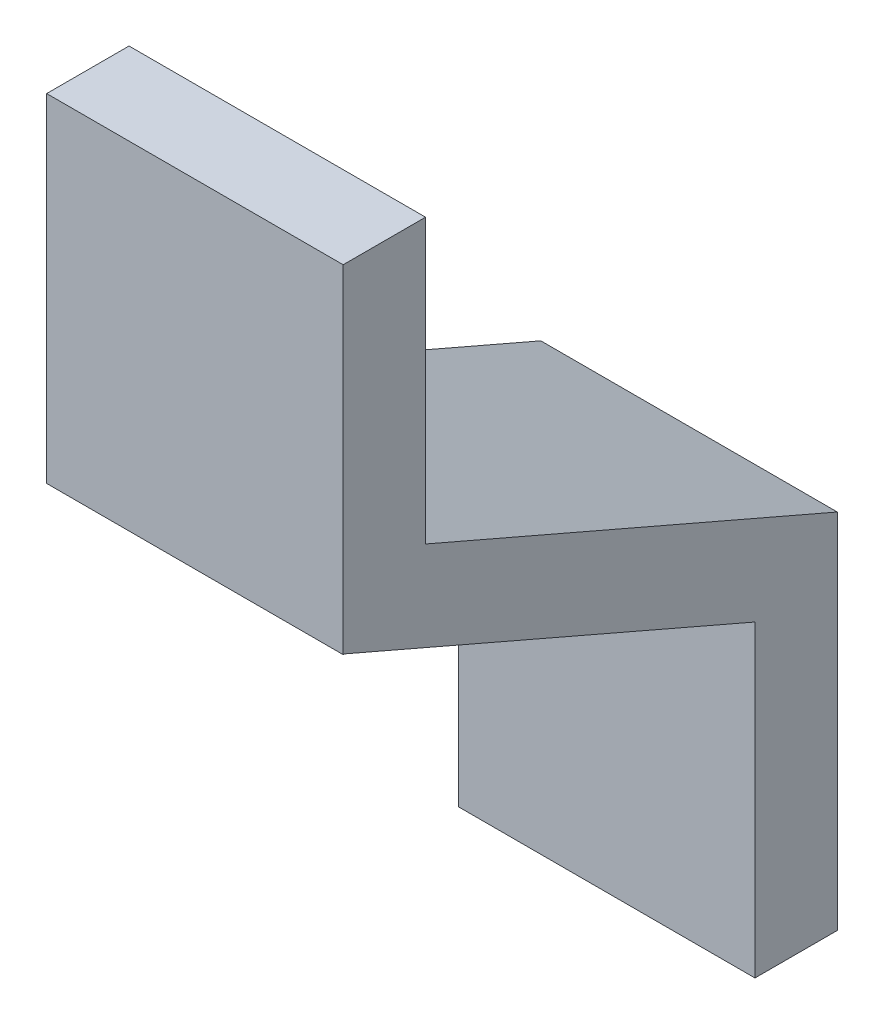
ISO-10303-21;
HEADER;
FILE_DESCRIPTION(('STEP AP214'),'2;1');
FILE_NAME('part.step','',(''),(''),'','','');
FILE_SCHEMA(('AUTOMOTIVE_DESIGN { 1 0 10303 214 1 1 1 1 }'));
ENDSEC;
DATA;
#1=APPLICATION_CONTEXT('core data for automotive mechanical design processes');
#2=APPLICATION_PROTOCOL_DEFINITION('international standard','automotive_design',2000,#1);
#3=PRODUCT_CONTEXT('',#1,'mechanical');
#4=PRODUCT('Part','Part','',(#3));
#5=PRODUCT_RELATED_PRODUCT_CATEGORY('part','',(#4));
#6=PRODUCT_DEFINITION_FORMATION('','',#4);
#7=PRODUCT_DEFINITION_CONTEXT('part definition',#1,'design');
#8=PRODUCT_DEFINITION('design','',#6,#7);
#9=PRODUCT_DEFINITION_SHAPE('','',#8);
#10=(LENGTH_UNIT() NAMED_UNIT(*) SI_UNIT(.MILLI.,.METRE.));
#11=(NAMED_UNIT(*) PLANE_ANGLE_UNIT() SI_UNIT($,.RADIAN.));
#12=(NAMED_UNIT(*) SI_UNIT($,.STERADIAN.) SOLID_ANGLE_UNIT());
#13=UNCERTAINTY_MEASURE_WITH_UNIT(LENGTH_MEASURE(1.E-05),#10,'distance_accuracy_value','');
#14=(GEOMETRIC_REPRESENTATION_CONTEXT(3) GLOBAL_UNCERTAINTY_ASSIGNED_CONTEXT((#13)) GLOBAL_UNIT_ASSIGNED_CONTEXT((#10,
#11,#12)) REPRESENTATION_CONTEXT('',''));
#15=CARTESIAN_POINT('',(0.,0.,0.));
#16=DIRECTION('',(0.,0.,1.));
#17=DIRECTION('',(1.,0.,0.));
#18=AXIS2_PLACEMENT_3D('',#15,#16,#17);
#19=CARTESIAN_POINT('',(5.02,0.999999996424,0.5));
#20=DIRECTION('',(0.,1.,0.));
#21=DIRECTION('',(0.,0.,1.));
#22=AXIS2_PLACEMENT_3D('',#19,#20,#21);
#23=PLANE('',#22);
#24=DIRECTION('',(1.,0.,0.));
#25=VECTOR('',#24,1.);
#26=CARTESIAN_POINT('',(5.02,0.999999996424,0.5));
#27=LINE('',#26,#25);
#28=CARTESIAN_POINT('',(5.380000014305,0.999999996424,0.5));
#29=VERTEX_POINT('',#28);
#30=CARTESIAN_POINT('',(5.02,0.999999996424,0.5));
#31=VERTEX_POINT('',#30);
#32=EDGE_CURVE('E140',#29,#31,#27,.F.);
#33=ORIENTED_EDGE('',*,*,#32,.T.);
#34=DIRECTION('',(0.,0.,-1.));
#35=VECTOR('',#34,1.);
#36=CARTESIAN_POINT('',(5.02,0.999999996424,0.));
#37=LINE('',#36,#35);
#38=CARTESIAN_POINT('',(5.02,0.999999996424,0.60000000149));
#39=VERTEX_POINT('',#38);
#40=EDGE_CURVE('E133',#31,#39,#37,.F.);
#41=ORIENTED_EDGE('',*,*,#40,.T.);
#42=DIRECTION('',(1.,0.,0.));
#43=VECTOR('',#42,1.);
#44=CARTESIAN_POINT('',(5.02,0.999999996424,0.60000000149));
#45=LINE('',#44,#43);
#46=CARTESIAN_POINT('',(5.380000014305,0.999999996424,0.60000000149));
#47=VERTEX_POINT('',#46);
#48=EDGE_CURVE('E129',#47,#39,#45,.F.);
#49=ORIENTED_EDGE('',*,*,#48,.F.);
#50=DIRECTION('',(0.,0.,-1.));
#51=VECTOR('',#50,1.);
#52=CARTESIAN_POINT('',(5.380000014305,0.999999996424,0.));
#53=LINE('',#52,#51);
#54=EDGE_CURVE('E106',#29,#47,#53,.F.);
#55=ORIENTED_EDGE('',*,*,#54,.F.);
#56=EDGE_LOOP('',(#33,#41,#49,#55));
#57=FACE_BOUND('',#56,.T.);
#58=ADVANCED_FACE('F17',(#57),#23,.T.);
#59=CARTESIAN_POINT('',(5.02,0.59,0.60000000149));
#60=DIRECTION('',(0.,0.,1.));
#61=DIRECTION('',(1.,0.,0.));
#62=AXIS2_PLACEMENT_3D('',#59,#60,#61);
#63=PLANE('',#62);
#64=DIRECTION('',(0.,1.,0.));
#65=VECTOR('',#64,1.);
#66=CARTESIAN_POINT('',(5.02,0.44,0.60000000149));
#67=LINE('',#66,#65);
#68=CARTESIAN_POINT('',(5.02,0.59,0.60000000149));
#69=VERTEX_POINT('',#68);
#70=EDGE_CURVE('E136',#39,#69,#67,.F.);
#71=ORIENTED_EDGE('',*,*,#70,.T.);
#72=DIRECTION('',(1.,0.,0.));
#73=VECTOR('',#72,1.);
#74=CARTESIAN_POINT('',(5.02,0.59,0.60000000149));
#75=LINE('',#74,#73);
#76=CARTESIAN_POINT('',(5.380000014305,0.59,0.60000000149));
#77=VERTEX_POINT('',#76);
#78=EDGE_CURVE('E92',#69,#77,#75,.T.);
#79=ORIENTED_EDGE('',*,*,#78,.T.);
#80=DIRECTION('',(0.,1.,0.));
#81=VECTOR('',#80,1.);
#82=CARTESIAN_POINT('',(5.380000014305,0.44,0.60000000149));
#83=LINE('',#82,#81);
#84=EDGE_CURVE('E73',#47,#77,#83,.F.);
#85=ORIENTED_EDGE('',*,*,#84,.F.);
#86=ORIENTED_EDGE('',*,*,#48,.T.);
#87=EDGE_LOOP('',(#71,#79,#85,#86));
#88=FACE_BOUND('',#87,.T.);
#89=ADVANCED_FACE('F285',(#88),#63,.T.);
#90=CARTESIAN_POINT('',(5.02,0.59,0.5));
#91=DIRECTION('',(0.,1.,0.));
#92=DIRECTION('',(0.,0.,1.));
#93=AXIS2_PLACEMENT_3D('',#90,#91,#92);
#94=PLANE('',#93);
#95=DIRECTION('',(1.,0.,0.));
#96=VECTOR('',#95,1.);
#97=CARTESIAN_POINT('',(5.02,0.590000000000416,0.59842599626982));
#98=LINE('',#97,#96);
#99=CARTESIAN_POINT('',(5.380000014305,0.590000000000104,0.598425996269911));
#100=VERTEX_POINT('',#99);
#101=CARTESIAN_POINT('',(5.02,0.590000000000104,0.59842599626991));
#102=VERTEX_POINT('',#101);
#103=EDGE_CURVE('E84',#100,#102,#98,.F.);
#104=ORIENTED_EDGE('',*,*,#103,.F.);
#105=DIRECTION('',(0.,0.,-1.));
#106=VECTOR('',#105,1.);
#107=CARTESIAN_POINT('',(5.380000014305,0.59,0.));
#108=LINE('',#107,#106);
#109=EDGE_CURVE('E20',#77,#100,#108,.T.);
#110=ORIENTED_EDGE('',*,*,#109,.F.);
#111=ORIENTED_EDGE('',*,*,#78,.F.);
#112=DIRECTION('',(0.,0.,1.));
#113=VECTOR('',#112,1.);
#114=CARTESIAN_POINT('',(5.02,0.59,0.5));
#115=LINE('',#114,#113);
#116=EDGE_CURVE('E87',#69,#102,#115,.F.);
#117=ORIENTED_EDGE('',*,*,#116,.T.);
#118=EDGE_LOOP('',(#104,#110,#111,#117));
#119=FACE_BOUND('',#118,.T.);
#120=ADVANCED_FACE('F85',(#119),#94,.F.);
#121=CARTESIAN_POINT('',(5.02,0.348224508223,0.03971472531736));
#122=DIRECTION('',(0.,-0.917754904098641,0.397147247255844));
#123=DIRECTION('',(0.,-0.397147247255844,-0.917754904098641));
#124=AXIS2_PLACEMENT_3D('',#121,#122,#123);
#125=PLANE('',#124);
#126=DIRECTION('',(0.,-0.397147247255413,-0.917754904098827));
#127=VECTOR('',#126,1.);
#128=CARTESIAN_POINT('',(5.380000014305,0.59,0.59842599627));
#129=LINE('',#128,#127);
#130=CARTESIAN_POINT('',(5.380000014305,0.37431222660502,0.10000000149));
#131=VERTEX_POINT('',#130);
#132=EDGE_CURVE('E80',#100,#131,#129,.T.);
#133=ORIENTED_EDGE('',*,*,#132,.F.);
#134=ORIENTED_EDGE('',*,*,#103,.T.);
#135=DIRECTION('',(0.,-0.397147247255413,-0.917754904098827));
#136=VECTOR('',#135,1.);
#137=CARTESIAN_POINT('',(5.02,0.59,0.59842599627));
#138=LINE('',#137,#136);
#139=CARTESIAN_POINT('',(5.02,0.374312226605,0.10000000149));
#140=VERTEX_POINT('',#139);
#141=EDGE_CURVE('E122',#102,#140,#138,.T.);
#142=ORIENTED_EDGE('',*,*,#141,.T.);
#143=DIRECTION('',(1.,0.,0.));
#144=VECTOR('',#143,1.);
#145=CARTESIAN_POINT('',(5.02,0.374312226605,0.10000000149));
#146=LINE('',#145,#144);
#147=EDGE_CURVE('E91',#131,#140,#146,.F.);
#148=ORIENTED_EDGE('',*,*,#147,.F.);
#149=EDGE_LOOP('',(#133,#134,#142,#148));
#150=FACE_BOUND('',#149,.T.);
#151=ADVANCED_FACE('F94',(#150),#125,.T.);
#152=CARTESIAN_POINT('',(5.02,0.,0.10000000149));
#153=DIRECTION('',(0.,0.,1.));
#154=DIRECTION('',(1.,0.,0.));
#155=AXIS2_PLACEMENT_3D('',#152,#153,#154);
#156=PLANE('',#155);
#157=ORIENTED_EDGE('',*,*,#147,.T.);
#158=DIRECTION('',(0.,1.,0.));
#159=VECTOR('',#158,1.);
#160=CARTESIAN_POINT('',(5.02,0.44,0.10000000149));
#161=LINE('',#160,#159);
#162=CARTESIAN_POINT('',(5.02,0.,0.10000000149));
#163=VERTEX_POINT('',#162);
#164=EDGE_CURVE('E118',#140,#163,#161,.F.);
#165=ORIENTED_EDGE('',*,*,#164,.T.);
#166=DIRECTION('',(1.,0.,0.));
#167=VECTOR('',#166,1.);
#168=CARTESIAN_POINT('',(5.02,0.,0.10000000149));
#169=LINE('',#168,#167);
#170=CARTESIAN_POINT('',(5.380000014305,0.,0.10000000149));
#171=VERTEX_POINT('',#170);
#172=EDGE_CURVE('E115',#163,#171,#169,.T.);
#173=ORIENTED_EDGE('',*,*,#172,.T.);
#174=DIRECTION('',(0.,1.,0.));
#175=VECTOR('',#174,1.);
#176=CARTESIAN_POINT('',(5.380000014305,0.44,0.10000000149));
#177=LINE('',#176,#175);
#178=EDGE_CURVE('E96',#131,#171,#177,.F.);
#179=ORIENTED_EDGE('',*,*,#178,.F.);
#180=EDGE_LOOP('',(#157,#165,#173,#179));
#181=FACE_BOUND('',#180,.T.);
#182=ADVANCED_FACE('F202',(#181),#156,.T.);
#183=CARTESIAN_POINT('',(5.02,0.,0.));
#184=DIRECTION('',(0.,1.,0.));
#185=DIRECTION('',(0.,0.,1.));
#186=AXIS2_PLACEMENT_3D('',#183,#184,#185);
#187=PLANE('',#186);
#188=DIRECTION('',(0.,0.,-1.));
#189=VECTOR('',#188,1.);
#190=CARTESIAN_POINT('',(5.02,0.,0.));
#191=LINE('',#190,#189);
#192=CARTESIAN_POINT('',(5.02,0.,0.));
#193=VERTEX_POINT('',#192);
#194=EDGE_CURVE('E121',#163,#193,#191,.T.);
#195=ORIENTED_EDGE('',*,*,#194,.T.);
#196=DIRECTION('',(1.,0.,0.));
#197=VECTOR('',#196,1.);
#198=CARTESIAN_POINT('',(5.02,0.,0.));
#199=LINE('',#198,#197);
#200=CARTESIAN_POINT('',(5.380000014305,0.,0.));
#201=VERTEX_POINT('',#200);
#202=EDGE_CURVE('E112',#193,#201,#199,.T.);
#203=ORIENTED_EDGE('',*,*,#202,.T.);
#204=DIRECTION('',(0.,0.,-1.));
#205=VECTOR('',#204,1.);
#206=CARTESIAN_POINT('',(5.380000014305,0.,0.));
#207=LINE('',#206,#205);
#208=EDGE_CURVE('E98',#171,#201,#207,.T.);
#209=ORIENTED_EDGE('',*,*,#208,.F.);
#210=ORIENTED_EDGE('',*,*,#172,.F.);
#211=EDGE_LOOP('',(#195,#203,#209,#210));
#212=FACE_BOUND('',#211,.T.);
#213=ADVANCED_FACE('F206',(#212),#187,.F.);
#214=CARTESIAN_POINT('',(5.02,0.,0.));
#215=DIRECTION('',(0.,0.,1.));
#216=DIRECTION('',(1.,0.,0.));
#217=AXIS2_PLACEMENT_3D('',#214,#215,#216);
#218=PLANE('',#217);
#219=ORIENTED_EDGE('',*,*,#202,.F.);
#220=DIRECTION('',(0.,1.,0.));
#221=VECTOR('',#220,1.);
#222=CARTESIAN_POINT('',(5.02,0.44,0.));
#223=LINE('',#222,#221);
#224=CARTESIAN_POINT('',(5.02,0.439999998997445,-1.94673175919965E-10));
#225=VERTEX_POINT('',#224);
#226=EDGE_CURVE('E178',#193,#225,#223,.T.);
#227=ORIENTED_EDGE('',*,*,#226,.T.);
#228=DIRECTION('',(1.,0.,0.));
#229=VECTOR('',#228,1.);
#230=CARTESIAN_POINT('',(5.02,0.43999999966303,-7.78692710220355E-10));
#231=LINE('',#230,#229);
#232=CARTESIAN_POINT('',(5.380000014305,0.439999998997445,-1.94673175919965E-10));
#233=VERTEX_POINT('',#232);
#234=EDGE_CURVE('E163',#225,#233,#231,.T.);
#235=ORIENTED_EDGE('',*,*,#234,.T.);
#236=DIRECTION('',(0.,1.,0.));
#237=VECTOR('',#236,1.);
#238=CARTESIAN_POINT('',(5.380000014305,0.44,0.));
#239=LINE('',#238,#237);
#240=EDGE_CURVE('E109',#201,#233,#239,.T.);
#241=ORIENTED_EDGE('',*,*,#240,.F.);
#242=EDGE_LOOP('',(#219,#227,#235,#241));
#243=FACE_BOUND('',#242,.T.);
#244=ADVANCED_FACE('F186',(#243),#218,.F.);
#245=CARTESIAN_POINT('',(5.380000014305,0.44,0.));
#246=DIRECTION('',(1.,0.,0.));
#247=DIRECTION('',(0.,0.,-1.));
#248=AXIS2_PLACEMENT_3D('',#245,#246,#247);
#249=PLANE('',#248);
#250=ORIENTED_EDGE('',*,*,#178,.T.);
#251=ORIENTED_EDGE('',*,*,#208,.T.);
#252=ORIENTED_EDGE('',*,*,#240,.T.);
#253=DIRECTION('',(0.,-0.397147247255844,-0.917754904098641));
#254=VECTOR('',#253,1.);
#255=CARTESIAN_POINT('',(5.380000014305,0.44,0.));
#256=LINE('',#255,#254);
#257=CARTESIAN_POINT('',(5.380000014305,0.656368904967003,0.499999999999999));
#258=VERTEX_POINT('',#257);
#259=EDGE_CURVE('E151',#233,#258,#256,.F.);
#260=ORIENTED_EDGE('',*,*,#259,.T.);
#261=DIRECTION('',(0.,1.,0.));
#262=VECTOR('',#261,1.);
#263=CARTESIAN_POINT('',(5.380000014305,0.59,0.5));
#264=LINE('',#263,#262);
#265=EDGE_CURVE('E144',#258,#29,#264,.T.);
#266=ORIENTED_EDGE('',*,*,#265,.T.);
#267=ORIENTED_EDGE('',*,*,#54,.T.);
#268=ORIENTED_EDGE('',*,*,#84,.T.);
#269=ORIENTED_EDGE('',*,*,#109,.T.);
#270=ORIENTED_EDGE('',*,*,#132,.T.);
#271=EDGE_LOOP('',(#250,#251,#252,#260,#266,#267,#268,#269,#270));
#272=FACE_BOUND('',#271,.T.);
#273=ADVANCED_FACE('F78',(#272),#249,.T.);
#274=CARTESIAN_POINT('',(5.02,0.59,0.5));
#275=DIRECTION('',(0.,0.,1.));
#276=DIRECTION('',(1.,0.,0.));
#277=AXIS2_PLACEMENT_3D('',#274,#275,#276);
#278=PLANE('',#277);
#279=ORIENTED_EDGE('',*,*,#265,.F.);
#280=DIRECTION('',(1.,0.,0.));
#281=VECTOR('',#280,1.);
#282=CARTESIAN_POINT('',(5.02,0.656368904967005,0.499999999999998));
#283=LINE('',#282,#281);
#284=CARTESIAN_POINT('',(5.02,0.656368904967001,0.5));
#285=VERTEX_POINT('',#284);
#286=EDGE_CURVE('E26',#258,#285,#283,.F.);
#287=ORIENTED_EDGE('',*,*,#286,.T.);
#288=DIRECTION('',(0.,1.,0.));
#289=VECTOR('',#288,1.);
#290=CARTESIAN_POINT('',(5.02,0.44,0.5));
#291=LINE('',#290,#289);
#292=EDGE_CURVE('E34',#285,#31,#291,.T.);
#293=ORIENTED_EDGE('',*,*,#292,.T.);
#294=ORIENTED_EDGE('',*,*,#32,.F.);
#295=EDGE_LOOP('',(#279,#287,#293,#294));
#296=FACE_BOUND('',#295,.T.);
#297=ADVANCED_FACE('F212',(#296),#278,.F.);
#298=CARTESIAN_POINT('',(5.02,0.44,0.));
#299=DIRECTION('',(1.,0.,0.));
#300=DIRECTION('',(0.,0.,-1.));
#301=AXIS2_PLACEMENT_3D('',#298,#299,#300);
#302=PLANE('',#301);
#303=ORIENTED_EDGE('',*,*,#226,.F.);
#304=ORIENTED_EDGE('',*,*,#194,.F.);
#305=ORIENTED_EDGE('',*,*,#164,.F.);
#306=ORIENTED_EDGE('',*,*,#141,.F.);
#307=ORIENTED_EDGE('',*,*,#116,.F.);
#308=ORIENTED_EDGE('',*,*,#70,.F.);
#309=ORIENTED_EDGE('',*,*,#40,.F.);
#310=ORIENTED_EDGE('',*,*,#292,.F.);
#311=DIRECTION('',(0.,-0.397147247255844,-0.917754904098641));
#312=VECTOR('',#311,1.);
#313=CARTESIAN_POINT('',(5.02,0.44,0.));
#314=LINE('',#313,#312);
#315=EDGE_CURVE('E11',#285,#225,#314,.T.);
#316=ORIENTED_EDGE('',*,*,#315,.T.);
#317=EDGE_LOOP('',(#303,#304,#305,#306,#307,#308,#309,#310,#316));
#318=FACE_BOUND('',#317,.T.);
#319=ADVANCED_FACE('F207',(#318),#302,.F.);
#320=CARTESIAN_POINT('',(5.02,0.44,0.));
#321=DIRECTION('',(0.,-0.917754904098641,0.397147247255844));
#322=DIRECTION('',(0.,-0.397147247255844,-0.917754904098641));
#323=AXIS2_PLACEMENT_3D('',#320,#321,#322);
#324=PLANE('',#323);
#325=ORIENTED_EDGE('',*,*,#286,.F.);
#326=ORIENTED_EDGE('',*,*,#259,.F.);
#327=ORIENTED_EDGE('',*,*,#234,.F.);
#328=ORIENTED_EDGE('',*,*,#315,.F.);
#329=EDGE_LOOP('',(#325,#326,#327,#328));
#330=FACE_BOUND('',#329,.T.);
#331=ADVANCED_FACE('F193',(#330),#324,.F.);
#332=CLOSED_SHELL('',(#58,#89,#120,#151,#182,#213,#244,#273,#297,#319,#331));
#333=MANIFOLD_SOLID_BREP('B1',#332);
#334=ADVANCED_BREP_SHAPE_REPRESENTATION('',(#18,#333),#14);
#335=SHAPE_DEFINITION_REPRESENTATION(#9,#334);
ENDSEC;
END-ISO-10303-21;
